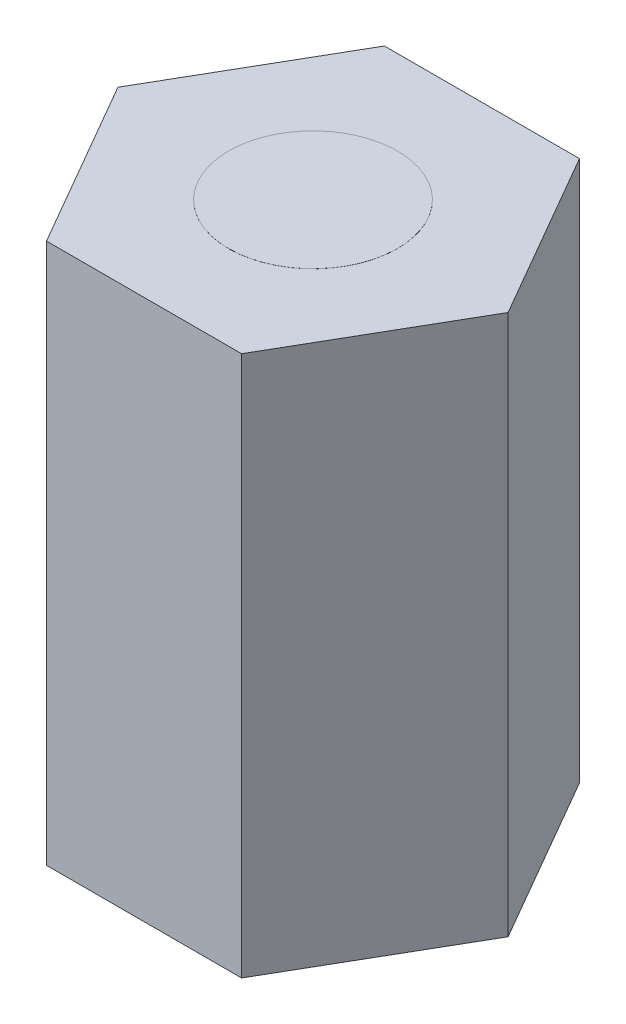
ISO-10303-21;
HEADER;
FILE_DESCRIPTION(('STEP AP214'),'2;1');
FILE_NAME('part.step','',(''),(''),'','','');
FILE_SCHEMA(('AUTOMOTIVE_DESIGN { 1 0 10303 214 1 1 1 1 }'));
ENDSEC;
DATA;
#1=APPLICATION_CONTEXT('core data for automotive mechanical design processes');
#2=APPLICATION_PROTOCOL_DEFINITION('international standard','automotive_design',2000,#1);
#3=PRODUCT_CONTEXT('',#1,'mechanical');
#4=PRODUCT('Part','Part','',(#3));
#5=PRODUCT_RELATED_PRODUCT_CATEGORY('part','',(#4));
#6=PRODUCT_DEFINITION_FORMATION('','',#4);
#7=PRODUCT_DEFINITION_CONTEXT('part definition',#1,'design');
#8=PRODUCT_DEFINITION('design','',#6,#7);
#9=PRODUCT_DEFINITION_SHAPE('','',#8);
#10=(LENGTH_UNIT() NAMED_UNIT(*) SI_UNIT(.MILLI.,.METRE.));
#11=(NAMED_UNIT(*) PLANE_ANGLE_UNIT() SI_UNIT($,.RADIAN.));
#12=(NAMED_UNIT(*) SI_UNIT($,.STERADIAN.) SOLID_ANGLE_UNIT());
#13=UNCERTAINTY_MEASURE_WITH_UNIT(LENGTH_MEASURE(1.E-05),#10,'distance_accuracy_value','');
#14=(GEOMETRIC_REPRESENTATION_CONTEXT(3) GLOBAL_UNCERTAINTY_ASSIGNED_CONTEXT((#13)) GLOBAL_UNIT_ASSIGNED_CONTEXT((#10,
#11,#12)) REPRESENTATION_CONTEXT('',''));
#15=CARTESIAN_POINT('',(0.,0.,0.));
#16=DIRECTION('',(0.,0.,1.));
#17=DIRECTION('',(1.,0.,0.));
#18=AXIS2_PLACEMENT_3D('',#15,#16,#17);
#19=CARTESIAN_POINT('',(-1.44337567297409,8.,-2.49999999999999));
#20=DIRECTION('',(0.866025403784441,0.,0.499999999999995));
#21=DIRECTION('',(0.499999999999995,0.,-0.866025403784441));
#22=AXIS2_PLACEMENT_3D('',#19,#20,#21);
#23=PLANE('',#22);
#24=DIRECTION('',(-0.499999999999995,0.,0.866025403784441));
#25=VECTOR('',#24,1.);
#26=CARTESIAN_POINT('',(-1.44337567297409,0.,-2.49999999999999));
#27=LINE('',#26,#25);
#28=CARTESIAN_POINT('',(-1.44337567297409,0.,-2.49999999999999));
#29=VERTEX_POINT('',#28);
#30=CARTESIAN_POINT('',(-2.88675134594813,0.,0.));
#31=VERTEX_POINT('',#30);
#32=EDGE_CURVE('E134',#29,#31,#27,.T.);
#33=ORIENTED_EDGE('',*,*,#32,.T.);
#34=DIRECTION('',(0.,-1.,0.));
#35=VECTOR('',#34,1.);
#36=CARTESIAN_POINT('',(-2.88675134594813,8.,0.));
#37=LINE('',#36,#35);
#38=CARTESIAN_POINT('',(-2.88675134594813,8.,0.));
#39=VERTEX_POINT('',#38);
#40=EDGE_CURVE('E46',#39,#31,#37,.T.);
#41=ORIENTED_EDGE('',*,*,#40,.F.);
#42=DIRECTION('',(-0.499999999999995,0.,0.866025403784441));
#43=VECTOR('',#42,1.);
#44=CARTESIAN_POINT('',(-1.44337567297409,8.,-2.49999999999999));
#45=LINE('',#44,#43);
#46=CARTESIAN_POINT('',(-1.44337567297409,8.,-2.49999999999999));
#47=VERTEX_POINT('',#46);
#48=EDGE_CURVE('E151',#47,#39,#45,.T.);
#49=ORIENTED_EDGE('',*,*,#48,.F.);
#50=DIRECTION('',(0.,-1.,0.));
#51=VECTOR('',#50,1.);
#52=CARTESIAN_POINT('',(-1.44337567297409,8.,-2.49999999999999));
#53=LINE('',#52,#51);
#54=EDGE_CURVE('E130',#47,#29,#53,.T.);
#55=ORIENTED_EDGE('',*,*,#54,.T.);
#56=EDGE_LOOP('',(#33,#41,#49,#55));
#57=FACE_BOUND('',#56,.T.);
#58=ADVANCED_FACE('F43',(#57),#23,.F.);
#59=CARTESIAN_POINT('',(-2.88675134594813,8.,0.));
#60=DIRECTION('',(0.866025403784438,0.,-0.500000000000001));
#61=DIRECTION('',(-0.500000000000001,0.,-0.866025403784438));
#62=AXIS2_PLACEMENT_3D('',#59,#60,#61);
#63=PLANE('',#62);
#64=DIRECTION('',(0.500000000000001,0.,0.866025403784438));
#65=VECTOR('',#64,1.);
#66=CARTESIAN_POINT('',(-2.88675134594813,0.,0.));
#67=LINE('',#66,#65);
#68=CARTESIAN_POINT('',(-1.44337567297406,0.,2.50000000000001));
#69=VERTEX_POINT('',#68);
#70=EDGE_CURVE('E138',#31,#69,#67,.T.);
#71=ORIENTED_EDGE('',*,*,#70,.T.);
#72=DIRECTION('',(0.,-1.,0.));
#73=VECTOR('',#72,1.);
#74=CARTESIAN_POINT('',(-1.44337567297406,8.,2.50000000000001));
#75=LINE('',#74,#73);
#76=CARTESIAN_POINT('',(-1.44337567297406,8.,2.50000000000001));
#77=VERTEX_POINT('',#76);
#78=EDGE_CURVE('E157',#77,#69,#75,.T.);
#79=ORIENTED_EDGE('',*,*,#78,.F.);
#80=DIRECTION('',(0.500000000000001,0.,0.866025403784438));
#81=VECTOR('',#80,1.);
#82=CARTESIAN_POINT('',(-2.88675134594813,8.,0.));
#83=LINE('',#82,#81);
#84=EDGE_CURVE('E99',#39,#77,#83,.T.);
#85=ORIENTED_EDGE('',*,*,#84,.F.);
#86=ORIENTED_EDGE('',*,*,#40,.T.);
#87=EDGE_LOOP('',(#71,#79,#85,#86));
#88=FACE_BOUND('',#87,.T.);
#89=ADVANCED_FACE('F164',(#88),#63,.F.);
#90=CARTESIAN_POINT('',(-1.44337567297406,8.,2.50000000000001));
#91=DIRECTION('',(0.,0.,-1.));
#92=DIRECTION('',(-1.,0.,0.));
#93=AXIS2_PLACEMENT_3D('',#90,#91,#92);
#94=PLANE('',#93);
#95=DIRECTION('',(1.,0.,0.));
#96=VECTOR('',#95,1.);
#97=CARTESIAN_POINT('',(-1.44337567297406,0.,2.50000000000001));
#98=LINE('',#97,#96);
#99=CARTESIAN_POINT('',(1.44337567297408,0.,2.5));
#100=VERTEX_POINT('',#99);
#101=EDGE_CURVE('E142',#69,#100,#98,.T.);
#102=ORIENTED_EDGE('',*,*,#101,.T.);
#103=DIRECTION('',(0.,-1.,0.));
#104=VECTOR('',#103,1.);
#105=CARTESIAN_POINT('',(1.44337567297408,8.,2.5));
#106=LINE('',#105,#104);
#107=CARTESIAN_POINT('',(1.44337567297408,8.,2.5));
#108=VERTEX_POINT('',#107);
#109=EDGE_CURVE('E123',#108,#100,#106,.T.);
#110=ORIENTED_EDGE('',*,*,#109,.F.);
#111=DIRECTION('',(1.,0.,0.));
#112=VECTOR('',#111,1.);
#113=CARTESIAN_POINT('',(-1.44337567297406,8.,2.50000000000001));
#114=LINE('',#113,#112);
#115=EDGE_CURVE('E112',#77,#108,#114,.T.);
#116=ORIENTED_EDGE('',*,*,#115,.F.);
#117=ORIENTED_EDGE('',*,*,#78,.T.);
#118=EDGE_LOOP('',(#102,#110,#116,#117));
#119=FACE_BOUND('',#118,.T.);
#120=ADVANCED_FACE('F170',(#119),#94,.F.);
#121=CARTESIAN_POINT('',(1.44337567297408,8.,2.5));
#122=DIRECTION('',(-0.866025403784441,0.,-0.499999999999995));
#123=DIRECTION('',(-0.499999999999995,0.,0.866025403784442));
#124=AXIS2_PLACEMENT_3D('',#121,#122,#123);
#125=PLANE('',#124);
#126=DIRECTION('',(0.499999999999995,0.,-0.866025403784441));
#127=VECTOR('',#126,1.);
#128=CARTESIAN_POINT('',(1.44337567297408,0.,2.5));
#129=LINE('',#128,#127);
#130=CARTESIAN_POINT('',(2.88675134594813,0.,0.));
#131=VERTEX_POINT('',#130);
#132=EDGE_CURVE('E121',#100,#131,#129,.T.);
#133=ORIENTED_EDGE('',*,*,#132,.T.);
#134=DIRECTION('',(0.,-1.,0.));
#135=VECTOR('',#134,1.);
#136=CARTESIAN_POINT('',(2.88675134594813,8.,0.));
#137=LINE('',#136,#135);
#138=CARTESIAN_POINT('',(2.88675134594813,8.,0.));
#139=VERTEX_POINT('',#138);
#140=EDGE_CURVE('E118',#139,#131,#137,.T.);
#141=ORIENTED_EDGE('',*,*,#140,.F.);
#142=DIRECTION('',(0.499999999999995,0.,-0.866025403784441));
#143=VECTOR('',#142,1.);
#144=CARTESIAN_POINT('',(1.44337567297408,8.,2.5));
#145=LINE('',#144,#143);
#146=EDGE_CURVE('E106',#108,#139,#145,.T.);
#147=ORIENTED_EDGE('',*,*,#146,.F.);
#148=ORIENTED_EDGE('',*,*,#109,.T.);
#149=EDGE_LOOP('',(#133,#141,#147,#148));
#150=FACE_BOUND('',#149,.T.);
#151=ADVANCED_FACE('F119',(#150),#125,.F.);
#152=CARTESIAN_POINT('',(2.88675134594813,8.,0.));
#153=DIRECTION('',(-0.866025403784435,0.,0.500000000000007));
#154=DIRECTION('',(0.500000000000007,0.,0.866025403784435));
#155=AXIS2_PLACEMENT_3D('',#152,#153,#154);
#156=PLANE('',#155);
#157=DIRECTION('',(-0.500000000000007,0.,-0.866025403784435));
#158=VECTOR('',#157,1.);
#159=CARTESIAN_POINT('',(2.88675134594813,0.,0.));
#160=LINE('',#159,#158);
#161=CARTESIAN_POINT('',(1.44337567297404,0.,-2.50000000000002));
#162=VERTEX_POINT('',#161);
#163=EDGE_CURVE('E84',#131,#162,#160,.T.);
#164=ORIENTED_EDGE('',*,*,#163,.T.);
#165=DIRECTION('',(0.,-1.,0.));
#166=VECTOR('',#165,1.);
#167=CARTESIAN_POINT('',(1.44337567297404,8.,-2.50000000000002));
#168=LINE('',#167,#166);
#169=CARTESIAN_POINT('',(1.44337567297404,8.,-2.50000000000002));
#170=VERTEX_POINT('',#169);
#171=EDGE_CURVE('E124',#170,#162,#168,.T.);
#172=ORIENTED_EDGE('',*,*,#171,.F.);
#173=DIRECTION('',(-0.500000000000007,0.,-0.866025403784435));
#174=VECTOR('',#173,1.);
#175=CARTESIAN_POINT('',(2.88675134594813,8.,0.));
#176=LINE('',#175,#174);
#177=EDGE_CURVE('E110',#139,#170,#176,.T.);
#178=ORIENTED_EDGE('',*,*,#177,.F.);
#179=ORIENTED_EDGE('',*,*,#140,.T.);
#180=EDGE_LOOP('',(#164,#172,#178,#179));
#181=FACE_BOUND('',#180,.T.);
#182=ADVANCED_FACE('F126',(#181),#156,.F.);
#183=CARTESIAN_POINT('',(1.44337567297404,8.,-2.50000000000002));
#184=DIRECTION('',(0.,0.,1.));
#185=DIRECTION('',(1.,0.,0.));
#186=AXIS2_PLACEMENT_3D('',#183,#184,#185);
#187=PLANE('',#186);
#188=DIRECTION('',(-1.,0.,0.));
#189=VECTOR('',#188,1.);
#190=CARTESIAN_POINT('',(1.44337567297404,0.,-2.50000000000002));
#191=LINE('',#190,#189);
#192=EDGE_CURVE('E90',#162,#29,#191,.T.);
#193=ORIENTED_EDGE('',*,*,#192,.T.);
#194=ORIENTED_EDGE('',*,*,#54,.F.);
#195=DIRECTION('',(-1.,0.,0.));
#196=VECTOR('',#195,1.);
#197=CARTESIAN_POINT('',(1.44337567297404,8.,-2.50000000000002));
#198=LINE('',#197,#196);
#199=EDGE_CURVE('E61',#170,#47,#198,.T.);
#200=ORIENTED_EDGE('',*,*,#199,.F.);
#201=ORIENTED_EDGE('',*,*,#171,.T.);
#202=EDGE_LOOP('',(#193,#194,#200,#201));
#203=FACE_BOUND('',#202,.T.);
#204=ADVANCED_FACE('F190',(#203),#187,.F.);
#205=CARTESIAN_POINT('',(0.,8.,0.));
#206=DIRECTION('',(0.,1.,0.));
#207=DIRECTION('',(0.,0.,1.));
#208=AXIS2_PLACEMENT_3D('',#205,#206,#207);
#209=PLANE('',#208);
#210=CARTESIAN_POINT('',(0.,8.,0.));
#211=DIRECTION('',(0.,1.,0.));
#212=DIRECTION('',(0.,0.,1.));
#213=AXIS2_PLACEMENT_3D('',#210,#211,#212);
#214=CIRCLE('',#213,1.25);
#215=CARTESIAN_POINT('',(0.,8.,1.25));
#216=VERTEX_POINT('',#215);
#217=EDGE_CURVE('E11',#216,#216,#214,.T.);
#218=ORIENTED_EDGE('',*,*,#217,.F.);
#219=EDGE_LOOP('',(#218));
#220=FACE_BOUND('',#219,.T.);
#221=ORIENTED_EDGE('',*,*,#48,.T.);
#222=ORIENTED_EDGE('',*,*,#84,.T.);
#223=ORIENTED_EDGE('',*,*,#115,.T.);
#224=ORIENTED_EDGE('',*,*,#146,.T.);
#225=ORIENTED_EDGE('',*,*,#177,.T.);
#226=ORIENTED_EDGE('',*,*,#199,.T.);
#227=EDGE_LOOP('',(#221,#222,#223,#224,#225,#226));
#228=FACE_BOUND('',#227,.T.);
#229=ADVANCED_FACE('F108',(#220,#228),#209,.T.);
#230=CARTESIAN_POINT('',(0.,0.,0.));
#231=DIRECTION('',(0.,1.,0.));
#232=DIRECTION('',(0.,0.,1.));
#233=AXIS2_PLACEMENT_3D('',#230,#231,#232);
#234=PLANE('',#233);
#235=ORIENTED_EDGE('',*,*,#32,.F.);
#236=ORIENTED_EDGE('',*,*,#192,.F.);
#237=ORIENTED_EDGE('',*,*,#163,.F.);
#238=ORIENTED_EDGE('',*,*,#132,.F.);
#239=ORIENTED_EDGE('',*,*,#101,.F.);
#240=ORIENTED_EDGE('',*,*,#70,.F.);
#241=EDGE_LOOP('',(#235,#236,#237,#238,#239,#240));
#242=FACE_BOUND('',#241,.T.);
#243=ADVANCED_FACE('F169',(#242),#234,.F.);
#244=CARTESIAN_POINT('',(0.,8.001,0.));
#245=DIRECTION('',(0.,-1.,0.));
#246=DIRECTION('',(0.,0.,-1.));
#247=AXIS2_PLACEMENT_3D('',#244,#245,#246);
#248=CYLINDRICAL_SURFACE('',#247,1.25);
#249=CARTESIAN_POINT('',(0.,8.001,0.));
#250=DIRECTION('',(0.,1.,0.));
#251=DIRECTION('',(0.,0.,1.));
#252=AXIS2_PLACEMENT_3D('',#249,#250,#251);
#253=CIRCLE('',#252,1.25);
#254=CARTESIAN_POINT('',(0.,8.001,1.25));
#255=VERTEX_POINT('',#254);
#256=EDGE_CURVE('E139',#255,#255,#253,.T.);
#257=ORIENTED_EDGE('',*,*,#256,.F.);
#258=EDGE_LOOP('',(#257));
#259=FACE_BOUND('',#258,.T.);
#260=ORIENTED_EDGE('',*,*,#217,.T.);
#261=EDGE_LOOP('',(#260));
#262=FACE_BOUND('',#261,.T.);
#263=ADVANCED_FACE('F183',(#259,#262),#248,.T.);
#264=CARTESIAN_POINT('',(0.,8.001,0.));
#265=DIRECTION('',(0.,1.,0.));
#266=DIRECTION('',(0.,0.,1.));
#267=AXIS2_PLACEMENT_3D('',#264,#265,#266);
#268=PLANE('',#267);
#269=ORIENTED_EDGE('',*,*,#256,.T.);
#270=EDGE_LOOP('',(#269));
#271=FACE_BOUND('',#270,.T.);
#272=ADVANCED_FACE('F181',(#271),#268,.T.);
#273=CLOSED_SHELL('',(#58,#89,#120,#151,#182,#204,#229,#243,#263,#272));
#274=MANIFOLD_SOLID_BREP('B2',#273);
#275=ADVANCED_BREP_SHAPE_REPRESENTATION('',(#18,#274),#14);
#276=SHAPE_DEFINITION_REPRESENTATION(#9,#275);
ENDSEC;
END-ISO-10303-21;
